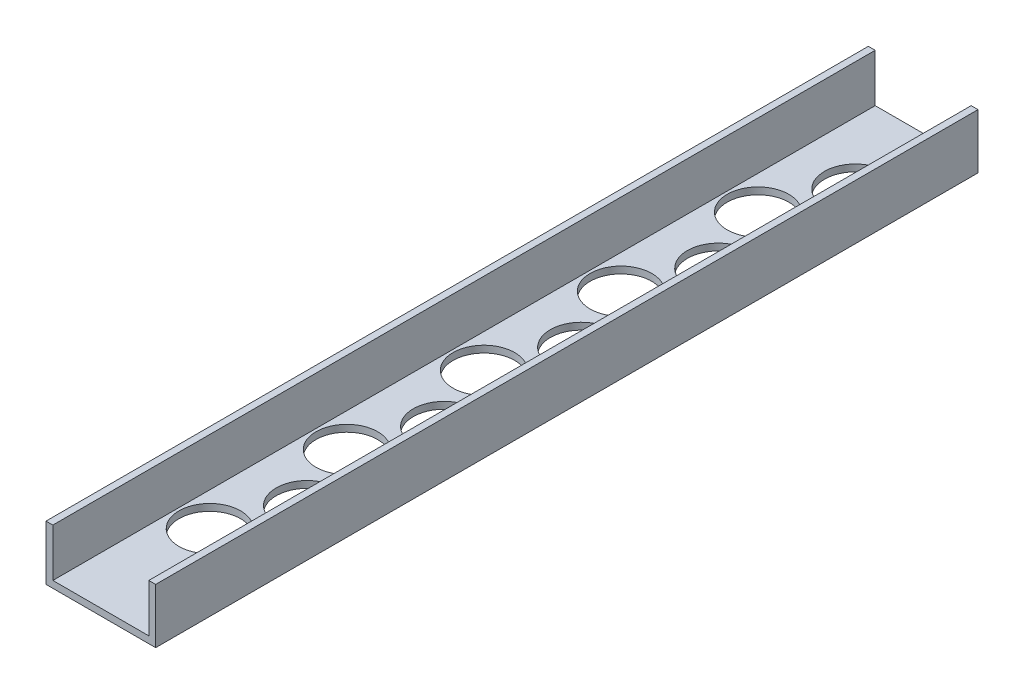
ISO-10303-21;
HEADER;
FILE_DESCRIPTION(('STEP AP214'),'2;1');
FILE_NAME('part.step','',(''),(''),'','','');
FILE_SCHEMA(('AUTOMOTIVE_DESIGN { 1 0 10303 214 1 1 1 1 }'));
ENDSEC;
DATA;
#1=APPLICATION_CONTEXT('core data for automotive mechanical design processes');
#2=APPLICATION_PROTOCOL_DEFINITION('international standard','automotive_design',2000,#1);
#3=PRODUCT_CONTEXT('',#1,'mechanical');
#4=PRODUCT('Part','Part','',(#3));
#5=PRODUCT_RELATED_PRODUCT_CATEGORY('part','',(#4));
#6=PRODUCT_DEFINITION_FORMATION('','',#4);
#7=PRODUCT_DEFINITION_CONTEXT('part definition',#1,'design');
#8=PRODUCT_DEFINITION('design','',#6,#7);
#9=PRODUCT_DEFINITION_SHAPE('','',#8);
#10=(LENGTH_UNIT() NAMED_UNIT(*) SI_UNIT(.MILLI.,.METRE.));
#11=(NAMED_UNIT(*) PLANE_ANGLE_UNIT() SI_UNIT($,.RADIAN.));
#12=(NAMED_UNIT(*) SI_UNIT($,.STERADIAN.) SOLID_ANGLE_UNIT());
#13=UNCERTAINTY_MEASURE_WITH_UNIT(LENGTH_MEASURE(1.E-05),#10,'distance_accuracy_value','');
#14=(GEOMETRIC_REPRESENTATION_CONTEXT(3) GLOBAL_UNCERTAINTY_ASSIGNED_CONTEXT((#13)) GLOBAL_UNIT_ASSIGNED_CONTEXT((#10,
#11,#12)) REPRESENTATION_CONTEXT('',''));
#15=CARTESIAN_POINT('',(0.,0.,0.));
#16=DIRECTION('',(0.,0.,1.));
#17=DIRECTION('',(1.,0.,0.));
#18=AXIS2_PLACEMENT_3D('',#15,#16,#17);
#19=CARTESIAN_POINT('',(0.,0.,381.));
#20=DIRECTION('',(1.,0.,0.));
#21=DIRECTION('',(0.,0.,-1.));
#22=AXIS2_PLACEMENT_3D('',#19,#20,#21);
#23=PLANE('',#22);
#24=DIRECTION('',(0.,-1.,0.));
#25=VECTOR('',#24,1.);
#26=CARTESIAN_POINT('',(0.,0.,0.));
#27=LINE('',#26,#25);
#28=CARTESIAN_POINT('',(0.,25.4,0.));
#29=VERTEX_POINT('',#28);
#30=CARTESIAN_POINT('',(0.,0.,0.));
#31=VERTEX_POINT('',#30);
#32=EDGE_CURVE('E131',#29,#31,#27,.T.);
#33=ORIENTED_EDGE('',*,*,#32,.T.);
#34=DIRECTION('',(0.,0.,-1.));
#35=VECTOR('',#34,1.);
#36=CARTESIAN_POINT('',(0.,0.,381.));
#37=LINE('',#36,#35);
#38=CARTESIAN_POINT('',(0.,0.,381.));
#39=VERTEX_POINT('',#38);
#40=EDGE_CURVE('E11',#39,#31,#37,.T.);
#41=ORIENTED_EDGE('',*,*,#40,.F.);
#42=DIRECTION('',(0.,-1.,0.));
#43=VECTOR('',#42,1.);
#44=CARTESIAN_POINT('',(0.,0.,381.));
#45=LINE('',#44,#43);
#46=CARTESIAN_POINT('',(0.,25.4,381.));
#47=VERTEX_POINT('',#46);
#48=EDGE_CURVE('E146',#47,#39,#45,.T.);
#49=ORIENTED_EDGE('',*,*,#48,.F.);
#50=DIRECTION('',(0.,0.,-1.));
#51=VECTOR('',#50,1.);
#52=CARTESIAN_POINT('',(0.,25.4,381.));
#53=LINE('',#52,#51);
#54=EDGE_CURVE('E127',#47,#29,#53,.T.);
#55=ORIENTED_EDGE('',*,*,#54,.T.);
#56=EDGE_LOOP('',(#33,#41,#49,#55));
#57=FACE_BOUND('',#56,.T.);
#58=ADVANCED_FACE('F35',(#57),#23,.F.);
#59=CARTESIAN_POINT('',(0.,0.,381.));
#60=DIRECTION('',(0.,1.,0.));
#61=DIRECTION('',(0.,0.,1.));
#62=AXIS2_PLACEMENT_3D('',#59,#60,#61);
#63=PLANE('',#62);
#64=CARTESIAN_POINT('',(32.0675,0.,38.1));
#65=DIRECTION('',(0.,1.,0.));
#66=DIRECTION('',(0.,0.,1.));
#67=AXIS2_PLACEMENT_3D('',#64,#65,#66);
#68=CIRCLE('',#67,14.2875);
#69=CARTESIAN_POINT('',(32.0675,0.,52.3875));
#70=VERTEX_POINT('',#69);
#71=EDGE_CURVE('E135',#70,#70,#68,.F.);
#72=ORIENTED_EDGE('',*,*,#71,.F.);
#73=EDGE_LOOP('',(#72));
#74=FACE_BOUND('',#73,.T.);
#75=CARTESIAN_POINT('',(18.7325,0.,69.85));
#76=DIRECTION('',(0.,1.,0.));
#77=DIRECTION('',(0.,0.,1.));
#78=AXIS2_PLACEMENT_3D('',#75,#76,#77);
#79=CIRCLE('',#78,14.2875);
#80=CARTESIAN_POINT('',(18.7325,0.,84.1375));
#81=VERTEX_POINT('',#80);
#82=EDGE_CURVE('E228',#81,#81,#79,.F.);
#83=ORIENTED_EDGE('',*,*,#82,.F.);
#84=EDGE_LOOP('',(#83));
#85=FACE_BOUND('',#84,.T.);
#86=CARTESIAN_POINT('',(32.0675,0.,101.6));
#87=DIRECTION('',(0.,1.,0.));
#88=DIRECTION('',(0.,0.,1.));
#89=AXIS2_PLACEMENT_3D('',#86,#87,#88);
#90=CIRCLE('',#89,14.2875);
#91=CARTESIAN_POINT('',(32.0675,0.,115.8875));
#92=VERTEX_POINT('',#91);
#93=EDGE_CURVE('E222',#92,#92,#90,.F.);
#94=ORIENTED_EDGE('',*,*,#93,.F.);
#95=EDGE_LOOP('',(#94));
#96=FACE_BOUND('',#95,.T.);
#97=CARTESIAN_POINT('',(18.7325,0.,133.35));
#98=DIRECTION('',(0.,1.,0.));
#99=DIRECTION('',(0.,0.,1.));
#100=AXIS2_PLACEMENT_3D('',#97,#98,#99);
#101=CIRCLE('',#100,14.2875);
#102=CARTESIAN_POINT('',(18.7325,0.,147.6375));
#103=VERTEX_POINT('',#102);
#104=EDGE_CURVE('E216',#103,#103,#101,.F.);
#105=ORIENTED_EDGE('',*,*,#104,.F.);
#106=EDGE_LOOP('',(#105));
#107=FACE_BOUND('',#106,.T.);
#108=CARTESIAN_POINT('',(32.0675,0.,165.1));
#109=DIRECTION('',(0.,1.,0.));
#110=DIRECTION('',(0.,0.,1.));
#111=AXIS2_PLACEMENT_3D('',#108,#109,#110);
#112=CIRCLE('',#111,14.2875);
#113=CARTESIAN_POINT('',(32.0675,0.,179.3875));
#114=VERTEX_POINT('',#113);
#115=EDGE_CURVE('E210',#114,#114,#112,.F.);
#116=ORIENTED_EDGE('',*,*,#115,.F.);
#117=EDGE_LOOP('',(#116));
#118=FACE_BOUND('',#117,.T.);
#119=CARTESIAN_POINT('',(18.7325,0.,196.85));
#120=DIRECTION('',(0.,1.,0.));
#121=DIRECTION('',(0.,0.,1.));
#122=AXIS2_PLACEMENT_3D('',#119,#120,#121);
#123=CIRCLE('',#122,14.2875);
#124=CARTESIAN_POINT('',(18.7325,0.,211.1375));
#125=VERTEX_POINT('',#124);
#126=EDGE_CURVE('E204',#125,#125,#123,.F.);
#127=ORIENTED_EDGE('',*,*,#126,.F.);
#128=EDGE_LOOP('',(#127));
#129=FACE_BOUND('',#128,.T.);
#130=CARTESIAN_POINT('',(32.0675,0.,228.6));
#131=DIRECTION('',(0.,1.,0.));
#132=DIRECTION('',(0.,0.,1.));
#133=AXIS2_PLACEMENT_3D('',#130,#131,#132);
#134=CIRCLE('',#133,14.2875);
#135=CARTESIAN_POINT('',(32.0675,0.,242.8875));
#136=VERTEX_POINT('',#135);
#137=EDGE_CURVE('E198',#136,#136,#134,.F.);
#138=ORIENTED_EDGE('',*,*,#137,.F.);
#139=EDGE_LOOP('',(#138));
#140=FACE_BOUND('',#139,.T.);
#141=CARTESIAN_POINT('',(18.7325,0.,260.35));
#142=DIRECTION('',(0.,1.,0.));
#143=DIRECTION('',(0.,0.,1.));
#144=AXIS2_PLACEMENT_3D('',#141,#142,#143);
#145=CIRCLE('',#144,14.2875);
#146=CARTESIAN_POINT('',(18.7325,0.,274.6375));
#147=VERTEX_POINT('',#146);
#148=EDGE_CURVE('E192',#147,#147,#145,.F.);
#149=ORIENTED_EDGE('',*,*,#148,.F.);
#150=EDGE_LOOP('',(#149));
#151=FACE_BOUND('',#150,.T.);
#152=CARTESIAN_POINT('',(32.0675,0.,292.1));
#153=DIRECTION('',(0.,1.,0.));
#154=DIRECTION('',(0.,0.,1.));
#155=AXIS2_PLACEMENT_3D('',#152,#153,#154);
#156=CIRCLE('',#155,14.2875);
#157=CARTESIAN_POINT('',(32.0675,0.,306.3875));
#158=VERTEX_POINT('',#157);
#159=EDGE_CURVE('E186',#158,#158,#156,.F.);
#160=ORIENTED_EDGE('',*,*,#159,.F.);
#161=EDGE_LOOP('',(#160));
#162=FACE_BOUND('',#161,.T.);
#163=CARTESIAN_POINT('',(18.7325,0.,323.85));
#164=DIRECTION('',(0.,1.,0.));
#165=DIRECTION('',(0.,0.,1.));
#166=AXIS2_PLACEMENT_3D('',#163,#164,#165);
#167=CIRCLE('',#166,14.2875);
#168=CARTESIAN_POINT('',(18.7325,0.,338.1375));
#169=VERTEX_POINT('',#168);
#170=EDGE_CURVE('E179',#169,#169,#167,.F.);
#171=ORIENTED_EDGE('',*,*,#170,.F.);
#172=EDGE_LOOP('',(#171));
#173=FACE_BOUND('',#172,.T.);
#174=DIRECTION('',(1.,0.,0.));
#175=VECTOR('',#174,1.);
#176=CARTESIAN_POINT('',(0.,0.,0.));
#177=LINE('',#176,#175);
#178=CARTESIAN_POINT('',(50.8,0.,0.));
#179=VERTEX_POINT('',#178);
#180=EDGE_CURVE('E134',#31,#179,#177,.T.);
#181=ORIENTED_EDGE('',*,*,#180,.T.);
#182=DIRECTION('',(0.,0.,-1.));
#183=VECTOR('',#182,1.);
#184=CARTESIAN_POINT('',(50.8,0.,381.));
#185=LINE('',#184,#183);
#186=CARTESIAN_POINT('',(50.8,0.,381.));
#187=VERTEX_POINT('',#186);
#188=EDGE_CURVE('E43',#187,#179,#185,.T.);
#189=ORIENTED_EDGE('',*,*,#188,.F.);
#190=DIRECTION('',(1.,0.,0.));
#191=VECTOR('',#190,1.);
#192=CARTESIAN_POINT('',(0.,0.,381.));
#193=LINE('',#192,#191);
#194=EDGE_CURVE('E94',#39,#187,#193,.T.);
#195=ORIENTED_EDGE('',*,*,#194,.F.);
#196=ORIENTED_EDGE('',*,*,#40,.T.);
#197=EDGE_LOOP('',(#181,#189,#195,#196));
#198=FACE_BOUND('',#197,.T.);
#199=ADVANCED_FACE('F270',(#74,#85,#96,#107,#118,#129,#140,#151,#162,#173,#198),#63,.F.);
#200=CARTESIAN_POINT('',(50.8,0.,381.));
#201=DIRECTION('',(-1.,0.,0.));
#202=DIRECTION('',(0.,0.,1.));
#203=AXIS2_PLACEMENT_3D('',#200,#201,#202);
#204=PLANE('',#203);
#205=DIRECTION('',(0.,1.,0.));
#206=VECTOR('',#205,1.);
#207=CARTESIAN_POINT('',(50.8,0.,0.));
#208=LINE('',#207,#206);
#209=CARTESIAN_POINT('',(50.8,25.4,0.));
#210=VERTEX_POINT('',#209);
#211=EDGE_CURVE('E137',#179,#210,#208,.T.);
#212=ORIENTED_EDGE('',*,*,#211,.T.);
#213=DIRECTION('',(0.,0.,-1.));
#214=VECTOR('',#213,1.);
#215=CARTESIAN_POINT('',(50.8,25.4,381.));
#216=LINE('',#215,#214);
#217=CARTESIAN_POINT('',(50.8,25.4,381.));
#218=VERTEX_POINT('',#217);
#219=EDGE_CURVE('E153',#218,#210,#216,.T.);
#220=ORIENTED_EDGE('',*,*,#219,.F.);
#221=DIRECTION('',(0.,1.,0.));
#222=VECTOR('',#221,1.);
#223=CARTESIAN_POINT('',(50.8,0.,381.));
#224=LINE('',#223,#222);
#225=EDGE_CURVE('E161',#187,#218,#224,.T.);
#226=ORIENTED_EDGE('',*,*,#225,.F.);
#227=ORIENTED_EDGE('',*,*,#188,.T.);
#228=EDGE_LOOP('',(#212,#220,#226,#227));
#229=FACE_BOUND('',#228,.T.);
#230=ADVANCED_FACE('F159',(#229),#204,.F.);
#231=CARTESIAN_POINT('',(50.8,25.4,381.));
#232=DIRECTION('',(0.,-1.,0.));
#233=DIRECTION('',(0.,0.,-1.));
#234=AXIS2_PLACEMENT_3D('',#231,#232,#233);
#235=PLANE('',#234);
#236=DIRECTION('',(-1.,0.,0.));
#237=VECTOR('',#236,1.);
#238=CARTESIAN_POINT('',(50.8,25.4,0.));
#239=LINE('',#238,#237);
#240=CARTESIAN_POINT('',(47.625,25.4,0.));
#241=VERTEX_POINT('',#240);
#242=EDGE_CURVE('E139',#210,#241,#239,.T.);
#243=ORIENTED_EDGE('',*,*,#242,.T.);
#244=DIRECTION('',(0.,0.,-1.));
#245=VECTOR('',#244,1.);
#246=CARTESIAN_POINT('',(47.625,25.4,381.));
#247=LINE('',#246,#245);
#248=CARTESIAN_POINT('',(47.625,25.4,381.));
#249=VERTEX_POINT('',#248);
#250=EDGE_CURVE('E150',#249,#241,#247,.T.);
#251=ORIENTED_EDGE('',*,*,#250,.F.);
#252=DIRECTION('',(-1.,0.,0.));
#253=VECTOR('',#252,1.);
#254=CARTESIAN_POINT('',(50.8,25.4,381.));
#255=LINE('',#254,#253);
#256=EDGE_CURVE('E173',#218,#249,#255,.T.);
#257=ORIENTED_EDGE('',*,*,#256,.F.);
#258=ORIENTED_EDGE('',*,*,#219,.T.);
#259=EDGE_LOOP('',(#243,#251,#257,#258));
#260=FACE_BOUND('',#259,.T.);
#261=ADVANCED_FACE('F169',(#260),#235,.F.);
#262=CARTESIAN_POINT('',(47.625,3.175,381.));
#263=DIRECTION('',(1.,0.,0.));
#264=DIRECTION('',(0.,0.,-1.));
#265=AXIS2_PLACEMENT_3D('',#262,#263,#264);
#266=PLANE('',#265);
#267=DIRECTION('',(0.,-1.,0.));
#268=VECTOR('',#267,1.);
#269=CARTESIAN_POINT('',(47.625,3.175,0.));
#270=LINE('',#269,#268);
#271=CARTESIAN_POINT('',(47.625,3.175,0.));
#272=VERTEX_POINT('',#271);
#273=EDGE_CURVE('E141',#241,#272,#270,.T.);
#274=ORIENTED_EDGE('',*,*,#273,.T.);
#275=DIRECTION('',(0.,0.,-1.));
#276=VECTOR('',#275,1.);
#277=CARTESIAN_POINT('',(47.625,3.175,381.));
#278=LINE('',#277,#276);
#279=CARTESIAN_POINT('',(47.625,3.175,381.));
#280=VERTEX_POINT('',#279);
#281=EDGE_CURVE('E122',#280,#272,#278,.T.);
#282=ORIENTED_EDGE('',*,*,#281,.F.);
#283=DIRECTION('',(0.,-1.,0.));
#284=VECTOR('',#283,1.);
#285=CARTESIAN_POINT('',(47.625,3.175,381.));
#286=LINE('',#285,#284);
#287=EDGE_CURVE('E113',#249,#280,#286,.T.);
#288=ORIENTED_EDGE('',*,*,#287,.F.);
#289=ORIENTED_EDGE('',*,*,#250,.T.);
#290=EDGE_LOOP('',(#274,#282,#288,#289));
#291=FACE_BOUND('',#290,.T.);
#292=ADVANCED_FACE('F172',(#291),#266,.F.);
#293=CARTESIAN_POINT('',(3.175,3.175,381.));
#294=DIRECTION('',(0.,-1.,0.));
#295=DIRECTION('',(0.,0.,-1.));
#296=AXIS2_PLACEMENT_3D('',#293,#294,#295);
#297=PLANE('',#296);
#298=CARTESIAN_POINT('',(32.0675,3.175,38.1));
#299=DIRECTION('',(0.,1.,0.));
#300=DIRECTION('',(0.,0.,1.));
#301=AXIS2_PLACEMENT_3D('',#298,#299,#300);
#302=CIRCLE('',#301,14.2875);
#303=CARTESIAN_POINT('',(32.0675,3.175,52.3875));
#304=VERTEX_POINT('',#303);
#305=EDGE_CURVE('E231',#304,#304,#302,.T.);
#306=ORIENTED_EDGE('',*,*,#305,.F.);
#307=EDGE_LOOP('',(#306));
#308=FACE_BOUND('',#307,.T.);
#309=CARTESIAN_POINT('',(18.7325,3.175,69.85));
#310=DIRECTION('',(0.,1.,0.));
#311=DIRECTION('',(0.,0.,1.));
#312=AXIS2_PLACEMENT_3D('',#309,#310,#311);
#313=CIRCLE('',#312,14.2875);
#314=CARTESIAN_POINT('',(18.7325,3.175,84.1375));
#315=VERTEX_POINT('',#314);
#316=EDGE_CURVE('E225',#315,#315,#313,.T.);
#317=ORIENTED_EDGE('',*,*,#316,.F.);
#318=EDGE_LOOP('',(#317));
#319=FACE_BOUND('',#318,.T.);
#320=CARTESIAN_POINT('',(32.0675,3.175,101.6));
#321=DIRECTION('',(0.,1.,0.));
#322=DIRECTION('',(0.,0.,1.));
#323=AXIS2_PLACEMENT_3D('',#320,#321,#322);
#324=CIRCLE('',#323,14.2875);
#325=CARTESIAN_POINT('',(32.0675,3.175,115.8875));
#326=VERTEX_POINT('',#325);
#327=EDGE_CURVE('E219',#326,#326,#324,.T.);
#328=ORIENTED_EDGE('',*,*,#327,.F.);
#329=EDGE_LOOP('',(#328));
#330=FACE_BOUND('',#329,.T.);
#331=CARTESIAN_POINT('',(18.7325,3.175,133.35));
#332=DIRECTION('',(0.,1.,0.));
#333=DIRECTION('',(0.,0.,1.));
#334=AXIS2_PLACEMENT_3D('',#331,#332,#333);
#335=CIRCLE('',#334,14.2875);
#336=CARTESIAN_POINT('',(18.7325,3.175,147.6375));
#337=VERTEX_POINT('',#336);
#338=EDGE_CURVE('E213',#337,#337,#335,.T.);
#339=ORIENTED_EDGE('',*,*,#338,.F.);
#340=EDGE_LOOP('',(#339));
#341=FACE_BOUND('',#340,.T.);
#342=CARTESIAN_POINT('',(32.0675,3.175,165.1));
#343=DIRECTION('',(0.,1.,0.));
#344=DIRECTION('',(0.,0.,1.));
#345=AXIS2_PLACEMENT_3D('',#342,#343,#344);
#346=CIRCLE('',#345,14.2875);
#347=CARTESIAN_POINT('',(32.0675,3.175,179.3875));
#348=VERTEX_POINT('',#347);
#349=EDGE_CURVE('E207',#348,#348,#346,.T.);
#350=ORIENTED_EDGE('',*,*,#349,.F.);
#351=EDGE_LOOP('',(#350));
#352=FACE_BOUND('',#351,.T.);
#353=CARTESIAN_POINT('',(18.7325,3.175,196.85));
#354=DIRECTION('',(0.,1.,0.));
#355=DIRECTION('',(0.,0.,1.));
#356=AXIS2_PLACEMENT_3D('',#353,#354,#355);
#357=CIRCLE('',#356,14.2875);
#358=CARTESIAN_POINT('',(18.7325,3.175,211.1375));
#359=VERTEX_POINT('',#358);
#360=EDGE_CURVE('E201',#359,#359,#357,.T.);
#361=ORIENTED_EDGE('',*,*,#360,.F.);
#362=EDGE_LOOP('',(#361));
#363=FACE_BOUND('',#362,.T.);
#364=CARTESIAN_POINT('',(32.0675,3.175,228.6));
#365=DIRECTION('',(0.,1.,0.));
#366=DIRECTION('',(0.,0.,1.));
#367=AXIS2_PLACEMENT_3D('',#364,#365,#366);
#368=CIRCLE('',#367,14.2875);
#369=CARTESIAN_POINT('',(32.0675,3.175,242.8875));
#370=VERTEX_POINT('',#369);
#371=EDGE_CURVE('E195',#370,#370,#368,.T.);
#372=ORIENTED_EDGE('',*,*,#371,.F.);
#373=EDGE_LOOP('',(#372));
#374=FACE_BOUND('',#373,.T.);
#375=CARTESIAN_POINT('',(18.7325,3.175,260.35));
#376=DIRECTION('',(0.,1.,0.));
#377=DIRECTION('',(0.,0.,1.));
#378=AXIS2_PLACEMENT_3D('',#375,#376,#377);
#379=CIRCLE('',#378,14.2875);
#380=CARTESIAN_POINT('',(18.7325,3.175,274.6375));
#381=VERTEX_POINT('',#380);
#382=EDGE_CURVE('E189',#381,#381,#379,.T.);
#383=ORIENTED_EDGE('',*,*,#382,.F.);
#384=EDGE_LOOP('',(#383));
#385=FACE_BOUND('',#384,.T.);
#386=CARTESIAN_POINT('',(32.0675,3.175,292.1));
#387=DIRECTION('',(0.,1.,0.));
#388=DIRECTION('',(0.,0.,1.));
#389=AXIS2_PLACEMENT_3D('',#386,#387,#388);
#390=CIRCLE('',#389,14.2875);
#391=CARTESIAN_POINT('',(32.0675,3.175,306.3875));
#392=VERTEX_POINT('',#391);
#393=EDGE_CURVE('E182',#392,#392,#390,.T.);
#394=ORIENTED_EDGE('',*,*,#393,.F.);
#395=EDGE_LOOP('',(#394));
#396=FACE_BOUND('',#395,.T.);
#397=CARTESIAN_POINT('',(18.7325,3.175,323.85));
#398=DIRECTION('',(0.,1.,0.));
#399=DIRECTION('',(0.,0.,1.));
#400=AXIS2_PLACEMENT_3D('',#397,#398,#399);
#401=CIRCLE('',#400,14.2875);
#402=CARTESIAN_POINT('',(18.7325,3.175,338.1375));
#403=VERTEX_POINT('',#402);
#404=EDGE_CURVE('E183',#403,#403,#401,.T.);
#405=ORIENTED_EDGE('',*,*,#404,.F.);
#406=EDGE_LOOP('',(#405));
#407=FACE_BOUND('',#406,.T.);
#408=DIRECTION('',(-1.,0.,0.));
#409=VECTOR('',#408,1.);
#410=CARTESIAN_POINT('',(3.175,3.175,0.));
#411=LINE('',#410,#409);
#412=CARTESIAN_POINT('',(3.175,3.175,0.));
#413=VERTEX_POINT('',#412);
#414=EDGE_CURVE('E121',#272,#413,#411,.T.);
#415=ORIENTED_EDGE('',*,*,#414,.T.);
#416=DIRECTION('',(0.,0.,-1.));
#417=VECTOR('',#416,1.);
#418=CARTESIAN_POINT('',(3.175,3.175,381.));
#419=LINE('',#418,#417);
#420=CARTESIAN_POINT('',(3.175,3.175,381.));
#421=VERTEX_POINT('',#420);
#422=EDGE_CURVE('E118',#421,#413,#419,.T.);
#423=ORIENTED_EDGE('',*,*,#422,.F.);
#424=DIRECTION('',(-1.,0.,0.));
#425=VECTOR('',#424,1.);
#426=CARTESIAN_POINT('',(3.175,3.175,381.));
#427=LINE('',#426,#425);
#428=EDGE_CURVE('E107',#280,#421,#427,.T.);
#429=ORIENTED_EDGE('',*,*,#428,.F.);
#430=ORIENTED_EDGE('',*,*,#281,.T.);
#431=EDGE_LOOP('',(#415,#423,#429,#430));
#432=FACE_BOUND('',#431,.T.);
#433=ADVANCED_FACE('F119',(#308,#319,#330,#341,#352,#363,#374,#385,#396,#407,#432),#297,.F.);
#434=CARTESIAN_POINT('',(3.175,3.175,381.));
#435=DIRECTION('',(-1.,0.,0.));
#436=DIRECTION('',(0.,0.,1.));
#437=AXIS2_PLACEMENT_3D('',#434,#435,#436);
#438=PLANE('',#437);
#439=DIRECTION('',(0.,1.,0.));
#440=VECTOR('',#439,1.);
#441=CARTESIAN_POINT('',(3.175,3.175,0.));
#442=LINE('',#441,#440);
#443=CARTESIAN_POINT('',(3.175,25.4,0.));
#444=VERTEX_POINT('',#443);
#445=EDGE_CURVE('E80',#413,#444,#442,.T.);
#446=ORIENTED_EDGE('',*,*,#445,.T.);
#447=DIRECTION('',(0.,0.,-1.));
#448=VECTOR('',#447,1.);
#449=CARTESIAN_POINT('',(3.175,25.4,381.));
#450=LINE('',#449,#448);
#451=CARTESIAN_POINT('',(3.175,25.4,381.));
#452=VERTEX_POINT('',#451);
#453=EDGE_CURVE('E123',#452,#444,#450,.T.);
#454=ORIENTED_EDGE('',*,*,#453,.F.);
#455=DIRECTION('',(0.,1.,0.));
#456=VECTOR('',#455,1.);
#457=CARTESIAN_POINT('',(3.175,3.175,381.));
#458=LINE('',#457,#456);
#459=EDGE_CURVE('E111',#421,#452,#458,.T.);
#460=ORIENTED_EDGE('',*,*,#459,.F.);
#461=ORIENTED_EDGE('',*,*,#422,.T.);
#462=EDGE_LOOP('',(#446,#454,#460,#461));
#463=FACE_BOUND('',#462,.T.);
#464=ADVANCED_FACE('F125',(#463),#438,.F.);
#465=CARTESIAN_POINT('',(0.,25.4,381.));
#466=DIRECTION('',(0.,-1.,0.));
#467=DIRECTION('',(0.,0.,-1.));
#468=AXIS2_PLACEMENT_3D('',#465,#466,#467);
#469=PLANE('',#468);
#470=DIRECTION('',(-1.,0.,0.));
#471=VECTOR('',#470,1.);
#472=CARTESIAN_POINT('',(0.,25.4,0.));
#473=LINE('',#472,#471);
#474=EDGE_CURVE('E86',#444,#29,#473,.T.);
#475=ORIENTED_EDGE('',*,*,#474,.T.);
#476=ORIENTED_EDGE('',*,*,#54,.F.);
#477=DIRECTION('',(-1.,0.,0.));
#478=VECTOR('',#477,1.);
#479=CARTESIAN_POINT('',(0.,25.4,381.));
#480=LINE('',#479,#478);
#481=EDGE_CURVE('E51',#452,#47,#480,.T.);
#482=ORIENTED_EDGE('',*,*,#481,.F.);
#483=ORIENTED_EDGE('',*,*,#453,.T.);
#484=EDGE_LOOP('',(#475,#476,#482,#483));
#485=FACE_BOUND('',#484,.T.);
#486=ADVANCED_FACE('F276',(#485),#469,.F.);
#487=CARTESIAN_POINT('',(0.,0.,381.));
#488=DIRECTION('',(0.,0.,-1.));
#489=DIRECTION('',(-1.,0.,0.));
#490=AXIS2_PLACEMENT_3D('',#487,#488,#489);
#491=PLANE('',#490);
#492=ORIENTED_EDGE('',*,*,#48,.T.);
#493=ORIENTED_EDGE('',*,*,#194,.T.);
#494=ORIENTED_EDGE('',*,*,#225,.T.);
#495=ORIENTED_EDGE('',*,*,#256,.T.);
#496=ORIENTED_EDGE('',*,*,#287,.T.);
#497=ORIENTED_EDGE('',*,*,#428,.T.);
#498=ORIENTED_EDGE('',*,*,#459,.T.);
#499=ORIENTED_EDGE('',*,*,#481,.T.);
#500=EDGE_LOOP('',(#492,#493,#494,#495,#496,#497,#498,#499));
#501=FACE_BOUND('',#500,.T.);
#502=ADVANCED_FACE('F109',(#501),#491,.F.);
#503=CARTESIAN_POINT('',(0.,0.,0.));
#504=DIRECTION('',(0.,0.,-1.));
#505=DIRECTION('',(-1.,0.,0.));
#506=AXIS2_PLACEMENT_3D('',#503,#504,#505);
#507=PLANE('',#506);
#508=ORIENTED_EDGE('',*,*,#32,.F.);
#509=ORIENTED_EDGE('',*,*,#474,.F.);
#510=ORIENTED_EDGE('',*,*,#445,.F.);
#511=ORIENTED_EDGE('',*,*,#414,.F.);
#512=ORIENTED_EDGE('',*,*,#273,.F.);
#513=ORIENTED_EDGE('',*,*,#242,.F.);
#514=ORIENTED_EDGE('',*,*,#211,.F.);
#515=ORIENTED_EDGE('',*,*,#180,.F.);
#516=EDGE_LOOP('',(#508,#509,#510,#511,#512,#513,#514,#515));
#517=FACE_BOUND('',#516,.T.);
#518=ADVANCED_FACE('F165',(#517),#507,.T.);
#519=CARTESIAN_POINT('',(18.7325,-0.00100000000000013,323.85));
#520=DIRECTION('',(0.,1.,0.));
#521=DIRECTION('',(0.,0.,1.));
#522=AXIS2_PLACEMENT_3D('',#519,#520,#521);
#523=CYLINDRICAL_SURFACE('',#522,14.2875);
#524=ORIENTED_EDGE('',*,*,#404,.T.);
#525=EDGE_LOOP('',(#524));
#526=FACE_BOUND('',#525,.T.);
#527=ORIENTED_EDGE('',*,*,#170,.T.);
#528=EDGE_LOOP('',(#527));
#529=FACE_BOUND('',#528,.T.);
#530=ADVANCED_FACE('F263',(#526,#529),#523,.F.);
#531=CARTESIAN_POINT('',(32.0675,-0.00100000000000013,292.1));
#532=DIRECTION('',(0.,1.,0.));
#533=DIRECTION('',(0.,0.,1.));
#534=AXIS2_PLACEMENT_3D('',#531,#532,#533);
#535=CYLINDRICAL_SURFACE('',#534,14.2875);
#536=ORIENTED_EDGE('',*,*,#393,.T.);
#537=EDGE_LOOP('',(#536));
#538=FACE_BOUND('',#537,.T.);
#539=ORIENTED_EDGE('',*,*,#159,.T.);
#540=EDGE_LOOP('',(#539));
#541=FACE_BOUND('',#540,.T.);
#542=ADVANCED_FACE('F266',(#538,#541),#535,.F.);
#543=CARTESIAN_POINT('',(18.7325,-0.00100000000000013,260.35));
#544=DIRECTION('',(0.,1.,0.));
#545=DIRECTION('',(0.,0.,1.));
#546=AXIS2_PLACEMENT_3D('',#543,#544,#545);
#547=CYLINDRICAL_SURFACE('',#546,14.2875);
#548=ORIENTED_EDGE('',*,*,#382,.T.);
#549=EDGE_LOOP('',(#548));
#550=FACE_BOUND('',#549,.T.);
#551=ORIENTED_EDGE('',*,*,#148,.T.);
#552=EDGE_LOOP('',(#551));
#553=FACE_BOUND('',#552,.T.);
#554=ADVANCED_FACE('F352',(#550,#553),#547,.F.);
#555=CARTESIAN_POINT('',(32.0675,-0.00100000000000013,228.6));
#556=DIRECTION('',(0.,1.,0.));
#557=DIRECTION('',(0.,0.,1.));
#558=AXIS2_PLACEMENT_3D('',#555,#556,#557);
#559=CYLINDRICAL_SURFACE('',#558,14.2875);
#560=ORIENTED_EDGE('',*,*,#371,.T.);
#561=EDGE_LOOP('',(#560));
#562=FACE_BOUND('',#561,.T.);
#563=ORIENTED_EDGE('',*,*,#137,.T.);
#564=EDGE_LOOP('',(#563));
#565=FACE_BOUND('',#564,.T.);
#566=ADVANCED_FACE('F360',(#562,#565),#559,.F.);
#567=CARTESIAN_POINT('',(18.7325,-0.00100000000000013,196.85));
#568=DIRECTION('',(0.,1.,0.));
#569=DIRECTION('',(0.,0.,1.));
#570=AXIS2_PLACEMENT_3D('',#567,#568,#569);
#571=CYLINDRICAL_SURFACE('',#570,14.2875);
#572=ORIENTED_EDGE('',*,*,#360,.T.);
#573=EDGE_LOOP('',(#572));
#574=FACE_BOUND('',#573,.T.);
#575=ORIENTED_EDGE('',*,*,#126,.T.);
#576=EDGE_LOOP('',(#575));
#577=FACE_BOUND('',#576,.T.);
#578=ADVANCED_FACE('F368',(#574,#577),#571,.F.);
#579=CARTESIAN_POINT('',(32.0675,-0.00100000000000013,165.1));
#580=DIRECTION('',(0.,1.,0.));
#581=DIRECTION('',(0.,0.,1.));
#582=AXIS2_PLACEMENT_3D('',#579,#580,#581);
#583=CYLINDRICAL_SURFACE('',#582,14.2875);
#584=ORIENTED_EDGE('',*,*,#349,.T.);
#585=EDGE_LOOP('',(#584));
#586=FACE_BOUND('',#585,.T.);
#587=ORIENTED_EDGE('',*,*,#115,.T.);
#588=EDGE_LOOP('',(#587));
#589=FACE_BOUND('',#588,.T.);
#590=ADVANCED_FACE('F376',(#586,#589),#583,.F.);
#591=CARTESIAN_POINT('',(18.7325,-0.00100000000000013,133.35));
#592=DIRECTION('',(0.,1.,0.));
#593=DIRECTION('',(0.,0.,1.));
#594=AXIS2_PLACEMENT_3D('',#591,#592,#593);
#595=CYLINDRICAL_SURFACE('',#594,14.2875);
#596=ORIENTED_EDGE('',*,*,#338,.T.);
#597=EDGE_LOOP('',(#596));
#598=FACE_BOUND('',#597,.T.);
#599=ORIENTED_EDGE('',*,*,#104,.T.);
#600=EDGE_LOOP('',(#599));
#601=FACE_BOUND('',#600,.T.);
#602=ADVANCED_FACE('F384',(#598,#601),#595,.F.);
#603=CARTESIAN_POINT('',(32.0675,-0.00100000000000013,101.6));
#604=DIRECTION('',(0.,1.,0.));
#605=DIRECTION('',(0.,0.,1.));
#606=AXIS2_PLACEMENT_3D('',#603,#604,#605);
#607=CYLINDRICAL_SURFACE('',#606,14.2875);
#608=ORIENTED_EDGE('',*,*,#327,.T.);
#609=EDGE_LOOP('',(#608));
#610=FACE_BOUND('',#609,.T.);
#611=ORIENTED_EDGE('',*,*,#93,.T.);
#612=EDGE_LOOP('',(#611));
#613=FACE_BOUND('',#612,.T.);
#614=ADVANCED_FACE('F392',(#610,#613),#607,.F.);
#615=CARTESIAN_POINT('',(18.7325,-0.00100000000000013,69.85));
#616=DIRECTION('',(0.,1.,0.));
#617=DIRECTION('',(0.,0.,1.));
#618=AXIS2_PLACEMENT_3D('',#615,#616,#617);
#619=CYLINDRICAL_SURFACE('',#618,14.2875);
#620=ORIENTED_EDGE('',*,*,#316,.T.);
#621=EDGE_LOOP('',(#620));
#622=FACE_BOUND('',#621,.T.);
#623=ORIENTED_EDGE('',*,*,#82,.T.);
#624=EDGE_LOOP('',(#623));
#625=FACE_BOUND('',#624,.T.);
#626=ADVANCED_FACE('F400',(#622,#625),#619,.F.);
#627=CARTESIAN_POINT('',(32.0675,-0.00100000000000013,38.1));
#628=DIRECTION('',(0.,1.,0.));
#629=DIRECTION('',(0.,0.,1.));
#630=AXIS2_PLACEMENT_3D('',#627,#628,#629);
#631=CYLINDRICAL_SURFACE('',#630,14.2875);
#632=ORIENTED_EDGE('',*,*,#305,.T.);
#633=EDGE_LOOP('',(#632));
#634=FACE_BOUND('',#633,.T.);
#635=ORIENTED_EDGE('',*,*,#71,.T.);
#636=EDGE_LOOP('',(#635));
#637=FACE_BOUND('',#636,.T.);
#638=ADVANCED_FACE('F239',(#634,#637),#631,.F.);
#639=CLOSED_SHELL('',(#58,#199,#230,#261,#292,#433,#464,#486,#502,#518,#530,#542,#554,#566,#578,
#590,#602,#614,#626,#638));
#640=MANIFOLD_SOLID_BREP('B2',#639);
#641=ADVANCED_BREP_SHAPE_REPRESENTATION('',(#18,#640),#14);
#642=SHAPE_DEFINITION_REPRESENTATION(#9,#641);
ENDSEC;
END-ISO-10303-21;
